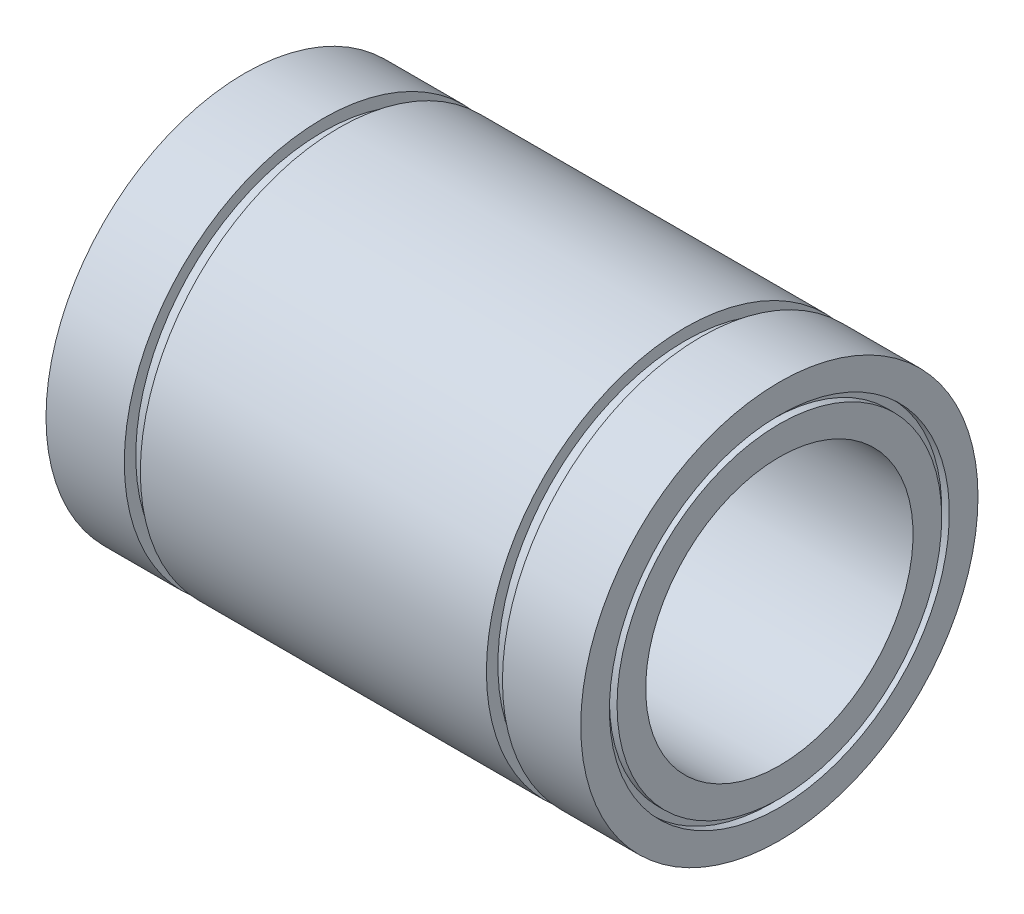
ISO-10303-21;
HEADER;
FILE_DESCRIPTION(('STEP AP214'),'2;1');
FILE_NAME('part.step','',(''),(''),'','','');
FILE_SCHEMA(('AUTOMOTIVE_DESIGN { 1 0 10303 214 1 1 1 1 }'));
ENDSEC;
DATA;
#1=APPLICATION_CONTEXT('core data for automotive mechanical design processes');
#2=APPLICATION_PROTOCOL_DEFINITION('international standard','automotive_design',2000,#1);
#3=PRODUCT_CONTEXT('',#1,'mechanical');
#4=PRODUCT('Part','Part','',(#3));
#5=PRODUCT_RELATED_PRODUCT_CATEGORY('part','',(#4));
#6=PRODUCT_DEFINITION_FORMATION('','',#4);
#7=PRODUCT_DEFINITION_CONTEXT('part definition',#1,'design');
#8=PRODUCT_DEFINITION('design','',#6,#7);
#9=PRODUCT_DEFINITION_SHAPE('','',#8);
#10=(LENGTH_UNIT() NAMED_UNIT(*) SI_UNIT(.MILLI.,.METRE.));
#11=(NAMED_UNIT(*) PLANE_ANGLE_UNIT() SI_UNIT($,.RADIAN.));
#12=(NAMED_UNIT(*) SI_UNIT($,.STERADIAN.) SOLID_ANGLE_UNIT());
#13=UNCERTAINTY_MEASURE_WITH_UNIT(LENGTH_MEASURE(1.E-05),#10,'distance_accuracy_value','');
#14=(GEOMETRIC_REPRESENTATION_CONTEXT(3) GLOBAL_UNCERTAINTY_ASSIGNED_CONTEXT((#13)) GLOBAL_UNIT_ASSIGNED_CONTEXT((#10,
#11,#12)) REPRESENTATION_CONTEXT('',''));
#15=CARTESIAN_POINT('',(0.,0.,0.));
#16=DIRECTION('',(0.,0.,1.));
#17=DIRECTION('',(1.,0.,0.));
#18=AXIS2_PLACEMENT_3D('',#15,#16,#17);
#19=CARTESIAN_POINT('',(-35.,22.25,0.));
#20=DIRECTION('',(-1.,0.,0.));
#21=DIRECTION('',(0.,-1.,0.));
#22=AXIS2_PLACEMENT_3D('',#19,#20,#21);
#23=PLANE('',#22);
#24=CARTESIAN_POINT('',(-35.,0.,0.));
#25=DIRECTION('',(1.,0.,0.));
#26=DIRECTION('',(0.,1.,0.));
#27=AXIS2_PLACEMENT_3D('',#24,#25,#26);
#28=CIRCLE('',#27,22.25);
#29=CARTESIAN_POINT('',(-35.,22.25,0.));
#30=VERTEX_POINT('',#29);
#31=EDGE_CURVE('E123',#30,#30,#28,.T.);
#32=ORIENTED_EDGE('',*,*,#31,.T.);
#33=EDGE_LOOP('',(#32));
#34=FACE_BOUND('',#33,.T.);
#35=CARTESIAN_POINT('',(-35.,0.,0.));
#36=DIRECTION('',(1.,0.,0.));
#37=DIRECTION('',(0.,1.,0.));
#38=AXIS2_PLACEMENT_3D('',#35,#36,#37);
#39=CIRCLE('',#38,26.);
#40=CARTESIAN_POINT('',(-35.,26.,0.));
#41=VERTEX_POINT('',#40);
#42=EDGE_CURVE('E10',#41,#41,#39,.T.);
#43=ORIENTED_EDGE('',*,*,#42,.F.);
#44=EDGE_LOOP('',(#43));
#45=FACE_BOUND('',#44,.T.);
#46=ADVANCED_FACE('F40',(#34,#45),#23,.T.);
#47=CARTESIAN_POINT('',(0.,0.,0.));
#48=DIRECTION('',(1.,0.,0.));
#49=DIRECTION('',(0.,1.,0.));
#50=AXIS2_PLACEMENT_3D('',#47,#48,#49);
#51=CYLINDRICAL_SURFACE('',#50,26.);
#52=ORIENTED_EDGE('',*,*,#42,.T.);
#53=EDGE_LOOP('',(#52));
#54=FACE_BOUND('',#53,.T.);
#55=CARTESIAN_POINT('',(-24.75,0.,0.));
#56=DIRECTION('',(1.,0.,0.));
#57=DIRECTION('',(0.,1.,0.));
#58=AXIS2_PLACEMENT_3D('',#55,#56,#57);
#59=CIRCLE('',#58,26.);
#60=CARTESIAN_POINT('',(-24.75,26.,0.));
#61=VERTEX_POINT('',#60);
#62=EDGE_CURVE('E47',#61,#61,#59,.T.);
#63=ORIENTED_EDGE('',*,*,#62,.F.);
#64=EDGE_LOOP('',(#63));
#65=FACE_BOUND('',#64,.T.);
#66=ADVANCED_FACE('F142',(#54,#65),#51,.T.);
#67=CARTESIAN_POINT('',(-24.75,26.,0.));
#68=DIRECTION('',(1.,0.,0.));
#69=DIRECTION('',(0.,1.,0.));
#70=AXIS2_PLACEMENT_3D('',#67,#68,#69);
#71=PLANE('',#70);
#72=ORIENTED_EDGE('',*,*,#62,.T.);
#73=EDGE_LOOP('',(#72));
#74=FACE_BOUND('',#73,.T.);
#75=CARTESIAN_POINT('',(-24.75,0.,0.));
#76=DIRECTION('',(1.,0.,0.));
#77=DIRECTION('',(0.,1.,0.));
#78=AXIS2_PLACEMENT_3D('',#75,#76,#77);
#79=CIRCLE('',#78,24.5);
#80=CARTESIAN_POINT('',(-24.75,24.5,0.));
#81=VERTEX_POINT('',#80);
#82=EDGE_CURVE('E53',#81,#81,#79,.T.);
#83=ORIENTED_EDGE('',*,*,#82,.F.);
#84=EDGE_LOOP('',(#83));
#85=FACE_BOUND('',#84,.T.);
#86=ADVANCED_FACE('F146',(#74,#85),#71,.T.);
#87=CARTESIAN_POINT('',(0.,0.,0.));
#88=DIRECTION('',(1.,0.,0.));
#89=DIRECTION('',(0.,1.,0.));
#90=AXIS2_PLACEMENT_3D('',#87,#88,#89);
#91=CYLINDRICAL_SURFACE('',#90,24.5);
#92=ORIENTED_EDGE('',*,*,#82,.T.);
#93=EDGE_LOOP('',(#92));
#94=FACE_BOUND('',#93,.T.);
#95=CARTESIAN_POINT('',(-22.65,0.,0.));
#96=DIRECTION('',(1.,0.,0.));
#97=DIRECTION('',(0.,1.,0.));
#98=AXIS2_PLACEMENT_3D('',#95,#96,#97);
#99=CIRCLE('',#98,24.5);
#100=CARTESIAN_POINT('',(-22.65,24.5,0.));
#101=VERTEX_POINT('',#100);
#102=EDGE_CURVE('E59',#101,#101,#99,.T.);
#103=ORIENTED_EDGE('',*,*,#102,.F.);
#104=EDGE_LOOP('',(#103));
#105=FACE_BOUND('',#104,.T.);
#106=ADVANCED_FACE('F150',(#94,#105),#91,.T.);
#107=CARTESIAN_POINT('',(-22.65,24.5,0.));
#108=DIRECTION('',(-1.,0.,0.));
#109=DIRECTION('',(0.,-1.,0.));
#110=AXIS2_PLACEMENT_3D('',#107,#108,#109);
#111=PLANE('',#110);
#112=ORIENTED_EDGE('',*,*,#102,.T.);
#113=EDGE_LOOP('',(#112));
#114=FACE_BOUND('',#113,.T.);
#115=CARTESIAN_POINT('',(-22.65,0.,0.));
#116=DIRECTION('',(1.,0.,0.));
#117=DIRECTION('',(0.,1.,0.));
#118=AXIS2_PLACEMENT_3D('',#115,#116,#117);
#119=CIRCLE('',#118,26.);
#120=CARTESIAN_POINT('',(-22.65,26.,0.));
#121=VERTEX_POINT('',#120);
#122=EDGE_CURVE('E65',#121,#121,#119,.T.);
#123=ORIENTED_EDGE('',*,*,#122,.F.);
#124=EDGE_LOOP('',(#123));
#125=FACE_BOUND('',#124,.T.);
#126=ADVANCED_FACE('F156',(#114,#125),#111,.T.);
#127=CARTESIAN_POINT('',(0.,0.,0.));
#128=DIRECTION('',(1.,0.,0.));
#129=DIRECTION('',(0.,1.,0.));
#130=AXIS2_PLACEMENT_3D('',#127,#128,#129);
#131=CYLINDRICAL_SURFACE('',#130,26.);
#132=ORIENTED_EDGE('',*,*,#122,.T.);
#133=EDGE_LOOP('',(#132));
#134=FACE_BOUND('',#133,.T.);
#135=CARTESIAN_POINT('',(22.65,0.,0.));
#136=DIRECTION('',(1.,0.,0.));
#137=DIRECTION('',(0.,1.,0.));
#138=AXIS2_PLACEMENT_3D('',#135,#136,#137);
#139=CIRCLE('',#138,26.);
#140=CARTESIAN_POINT('',(22.65,26.,0.));
#141=VERTEX_POINT('',#140);
#142=EDGE_CURVE('E68',#141,#141,#139,.T.);
#143=ORIENTED_EDGE('',*,*,#142,.F.);
#144=EDGE_LOOP('',(#143));
#145=FACE_BOUND('',#144,.T.);
#146=ADVANCED_FACE('F160',(#134,#145),#131,.T.);
#147=CARTESIAN_POINT('',(22.65,26.,0.));
#148=DIRECTION('',(1.,0.,0.));
#149=DIRECTION('',(0.,1.,0.));
#150=AXIS2_PLACEMENT_3D('',#147,#148,#149);
#151=PLANE('',#150);
#152=ORIENTED_EDGE('',*,*,#142,.T.);
#153=EDGE_LOOP('',(#152));
#154=FACE_BOUND('',#153,.T.);
#155=CARTESIAN_POINT('',(22.65,0.,0.));
#156=DIRECTION('',(1.,0.,0.));
#157=DIRECTION('',(0.,1.,0.));
#158=AXIS2_PLACEMENT_3D('',#155,#156,#157);
#159=CIRCLE('',#158,24.5);
#160=CARTESIAN_POINT('',(22.65,24.5,0.));
#161=VERTEX_POINT('',#160);
#162=EDGE_CURVE('E72',#161,#161,#159,.T.);
#163=ORIENTED_EDGE('',*,*,#162,.F.);
#164=EDGE_LOOP('',(#163));
#165=FACE_BOUND('',#164,.T.);
#166=ADVANCED_FACE('F164',(#154,#165),#151,.T.);
#167=CARTESIAN_POINT('',(0.,0.,0.));
#168=DIRECTION('',(1.,0.,0.));
#169=DIRECTION('',(0.,1.,0.));
#170=AXIS2_PLACEMENT_3D('',#167,#168,#169);
#171=CYLINDRICAL_SURFACE('',#170,24.5);
#172=ORIENTED_EDGE('',*,*,#162,.T.);
#173=EDGE_LOOP('',(#172));
#174=FACE_BOUND('',#173,.T.);
#175=CARTESIAN_POINT('',(24.75,0.,0.));
#176=DIRECTION('',(1.,0.,0.));
#177=DIRECTION('',(0.,1.,0.));
#178=AXIS2_PLACEMENT_3D('',#175,#176,#177);
#179=CIRCLE('',#178,24.5);
#180=CARTESIAN_POINT('',(24.75,24.5,0.));
#181=VERTEX_POINT('',#180);
#182=EDGE_CURVE('E76',#181,#181,#179,.T.);
#183=ORIENTED_EDGE('',*,*,#182,.F.);
#184=EDGE_LOOP('',(#183));
#185=FACE_BOUND('',#184,.T.);
#186=ADVANCED_FACE('F168',(#174,#185),#171,.T.);
#187=CARTESIAN_POINT('',(24.75,24.5,0.));
#188=DIRECTION('',(-1.,0.,0.));
#189=DIRECTION('',(0.,-1.,0.));
#190=AXIS2_PLACEMENT_3D('',#187,#188,#189);
#191=PLANE('',#190);
#192=ORIENTED_EDGE('',*,*,#182,.T.);
#193=EDGE_LOOP('',(#192));
#194=FACE_BOUND('',#193,.T.);
#195=CARTESIAN_POINT('',(24.75,0.,0.));
#196=DIRECTION('',(1.,0.,0.));
#197=DIRECTION('',(0.,1.,0.));
#198=AXIS2_PLACEMENT_3D('',#195,#196,#197);
#199=CIRCLE('',#198,26.);
#200=CARTESIAN_POINT('',(24.75,26.,0.));
#201=VERTEX_POINT('',#200);
#202=EDGE_CURVE('E80',#201,#201,#199,.T.);
#203=ORIENTED_EDGE('',*,*,#202,.F.);
#204=EDGE_LOOP('',(#203));
#205=FACE_BOUND('',#204,.T.);
#206=ADVANCED_FACE('F172',(#194,#205),#191,.T.);
#207=CARTESIAN_POINT('',(0.,0.,0.));
#208=DIRECTION('',(1.,0.,0.));
#209=DIRECTION('',(0.,1.,0.));
#210=AXIS2_PLACEMENT_3D('',#207,#208,#209);
#211=CYLINDRICAL_SURFACE('',#210,26.);
#212=ORIENTED_EDGE('',*,*,#202,.T.);
#213=EDGE_LOOP('',(#212));
#214=FACE_BOUND('',#213,.T.);
#215=CARTESIAN_POINT('',(35.,0.,0.));
#216=DIRECTION('',(1.,0.,0.));
#217=DIRECTION('',(0.,1.,0.));
#218=AXIS2_PLACEMENT_3D('',#215,#216,#217);
#219=CIRCLE('',#218,25.9999999999999);
#220=CARTESIAN_POINT('',(35.,25.9999999999999,0.));
#221=VERTEX_POINT('',#220);
#222=EDGE_CURVE('E84',#221,#221,#219,.T.);
#223=ORIENTED_EDGE('',*,*,#222,.F.);
#224=EDGE_LOOP('',(#223));
#225=FACE_BOUND('',#224,.T.);
#226=ADVANCED_FACE('F176',(#214,#225),#211,.T.);
#227=CARTESIAN_POINT('',(35.,25.9999999999999,0.));
#228=DIRECTION('',(1.,0.,0.));
#229=DIRECTION('',(0.,1.,0.));
#230=AXIS2_PLACEMENT_3D('',#227,#228,#229);
#231=PLANE('',#230);
#232=ORIENTED_EDGE('',*,*,#222,.T.);
#233=EDGE_LOOP('',(#232));
#234=FACE_BOUND('',#233,.T.);
#235=CARTESIAN_POINT('',(35.,0.,0.));
#236=DIRECTION('',(1.,0.,0.));
#237=DIRECTION('',(0.,1.,0.));
#238=AXIS2_PLACEMENT_3D('',#235,#236,#237);
#239=CIRCLE('',#238,22.25);
#240=CARTESIAN_POINT('',(35.,22.25,0.));
#241=VERTEX_POINT('',#240);
#242=EDGE_CURVE('E88',#241,#241,#239,.T.);
#243=ORIENTED_EDGE('',*,*,#242,.F.);
#244=EDGE_LOOP('',(#243));
#245=FACE_BOUND('',#244,.T.);
#246=ADVANCED_FACE('F180',(#234,#245),#231,.T.);
#247=CARTESIAN_POINT('',(0.,0.,0.));
#248=DIRECTION('',(1.,0.,0.));
#249=DIRECTION('',(0.,1.,0.));
#250=AXIS2_PLACEMENT_3D('',#247,#248,#249);
#251=CYLINDRICAL_SURFACE('',#250,22.25);
#252=ORIENTED_EDGE('',*,*,#242,.T.);
#253=EDGE_LOOP('',(#252));
#254=FACE_BOUND('',#253,.T.);
#255=CARTESIAN_POINT('',(34.,0.,0.));
#256=DIRECTION('',(1.,0.,0.));
#257=DIRECTION('',(0.,1.,0.));
#258=AXIS2_PLACEMENT_3D('',#255,#256,#257);
#259=CIRCLE('',#258,22.25);
#260=CARTESIAN_POINT('',(34.,22.25,0.));
#261=VERTEX_POINT('',#260);
#262=EDGE_CURVE('E92',#261,#261,#259,.T.);
#263=ORIENTED_EDGE('',*,*,#262,.F.);
#264=EDGE_LOOP('',(#263));
#265=FACE_BOUND('',#264,.T.);
#266=ADVANCED_FACE('F184',(#254,#265),#251,.F.);
#267=CARTESIAN_POINT('',(34.,22.25,0.));
#268=DIRECTION('',(1.,0.,0.));
#269=DIRECTION('',(0.,1.,0.));
#270=AXIS2_PLACEMENT_3D('',#267,#268,#269);
#271=PLANE('',#270);
#272=ORIENTED_EDGE('',*,*,#262,.T.);
#273=EDGE_LOOP('',(#272));
#274=FACE_BOUND('',#273,.T.);
#275=CARTESIAN_POINT('',(34.,0.,0.));
#276=DIRECTION('',(1.,0.,0.));
#277=DIRECTION('',(0.,1.,0.));
#278=AXIS2_PLACEMENT_3D('',#275,#276,#277);
#279=CIRCLE('',#278,21.25);
#280=CARTESIAN_POINT('',(34.,21.25,0.));
#281=VERTEX_POINT('',#280);
#282=EDGE_CURVE('E96',#281,#281,#279,.T.);
#283=ORIENTED_EDGE('',*,*,#282,.F.);
#284=EDGE_LOOP('',(#283));
#285=FACE_BOUND('',#284,.T.);
#286=ADVANCED_FACE('F188',(#274,#285),#271,.T.);
#287=CARTESIAN_POINT('',(0.,0.,0.));
#288=DIRECTION('',(1.,0.,0.));
#289=DIRECTION('',(0.,1.,0.));
#290=AXIS2_PLACEMENT_3D('',#287,#288,#289);
#291=CYLINDRICAL_SURFACE('',#290,21.25);
#292=ORIENTED_EDGE('',*,*,#282,.T.);
#293=EDGE_LOOP('',(#292));
#294=FACE_BOUND('',#293,.T.);
#295=CARTESIAN_POINT('',(35.,0.,0.));
#296=DIRECTION('',(1.,0.,0.));
#297=DIRECTION('',(0.,1.,0.));
#298=AXIS2_PLACEMENT_3D('',#295,#296,#297);
#299=CIRCLE('',#298,21.25);
#300=CARTESIAN_POINT('',(35.,21.25,0.));
#301=VERTEX_POINT('',#300);
#302=EDGE_CURVE('E100',#301,#301,#299,.T.);
#303=ORIENTED_EDGE('',*,*,#302,.F.);
#304=EDGE_LOOP('',(#303));
#305=FACE_BOUND('',#304,.T.);
#306=ADVANCED_FACE('F192',(#294,#305),#291,.T.);
#307=CARTESIAN_POINT('',(35.,21.25,0.));
#308=DIRECTION('',(1.,0.,0.));
#309=DIRECTION('',(0.,1.,0.));
#310=AXIS2_PLACEMENT_3D('',#307,#308,#309);
#311=PLANE('',#310);
#312=ORIENTED_EDGE('',*,*,#302,.T.);
#313=EDGE_LOOP('',(#312));
#314=FACE_BOUND('',#313,.T.);
#315=CARTESIAN_POINT('',(35.,0.,0.));
#316=DIRECTION('',(1.,0.,0.));
#317=DIRECTION('',(0.,1.,0.));
#318=AXIS2_PLACEMENT_3D('',#315,#316,#317);
#319=CIRCLE('',#318,17.5);
#320=CARTESIAN_POINT('',(35.,17.5,0.));
#321=VERTEX_POINT('',#320);
#322=EDGE_CURVE('E104',#321,#321,#319,.T.);
#323=ORIENTED_EDGE('',*,*,#322,.F.);
#324=EDGE_LOOP('',(#323));
#325=FACE_BOUND('',#324,.T.);
#326=ADVANCED_FACE('F196',(#314,#325),#311,.T.);
#327=CARTESIAN_POINT('',(0.,0.,0.));
#328=DIRECTION('',(1.,0.,0.));
#329=DIRECTION('',(0.,1.,0.));
#330=AXIS2_PLACEMENT_3D('',#327,#328,#329);
#331=CYLINDRICAL_SURFACE('',#330,17.5);
#332=ORIENTED_EDGE('',*,*,#322,.T.);
#333=EDGE_LOOP('',(#332));
#334=FACE_BOUND('',#333,.T.);
#335=CARTESIAN_POINT('',(-35.,0.,0.));
#336=DIRECTION('',(1.,0.,0.));
#337=DIRECTION('',(0.,1.,0.));
#338=AXIS2_PLACEMENT_3D('',#335,#336,#337);
#339=CIRCLE('',#338,17.5);
#340=CARTESIAN_POINT('',(-35.,17.5,0.));
#341=VERTEX_POINT('',#340);
#342=EDGE_CURVE('E108',#341,#341,#339,.T.);
#343=ORIENTED_EDGE('',*,*,#342,.F.);
#344=EDGE_LOOP('',(#343));
#345=FACE_BOUND('',#344,.T.);
#346=ADVANCED_FACE('F200',(#334,#345),#331,.F.);
#347=CARTESIAN_POINT('',(-35.,17.5,0.));
#348=DIRECTION('',(-1.,0.,0.));
#349=DIRECTION('',(0.,-1.,0.));
#350=AXIS2_PLACEMENT_3D('',#347,#348,#349);
#351=PLANE('',#350);
#352=ORIENTED_EDGE('',*,*,#342,.T.);
#353=EDGE_LOOP('',(#352));
#354=FACE_BOUND('',#353,.T.);
#355=CARTESIAN_POINT('',(-35.,0.,0.));
#356=DIRECTION('',(1.,0.,0.));
#357=DIRECTION('',(0.,1.,0.));
#358=AXIS2_PLACEMENT_3D('',#355,#356,#357);
#359=CIRCLE('',#358,21.25);
#360=CARTESIAN_POINT('',(-35.,21.25,0.));
#361=VERTEX_POINT('',#360);
#362=EDGE_CURVE('E111',#361,#361,#359,.T.);
#363=ORIENTED_EDGE('',*,*,#362,.F.);
#364=EDGE_LOOP('',(#363));
#365=FACE_BOUND('',#364,.T.);
#366=ADVANCED_FACE('F204',(#354,#365),#351,.T.);
#367=CARTESIAN_POINT('',(0.,0.,0.));
#368=DIRECTION('',(1.,0.,0.));
#369=DIRECTION('',(0.,1.,0.));
#370=AXIS2_PLACEMENT_3D('',#367,#368,#369);
#371=CYLINDRICAL_SURFACE('',#370,21.25);
#372=ORIENTED_EDGE('',*,*,#362,.T.);
#373=EDGE_LOOP('',(#372));
#374=FACE_BOUND('',#373,.T.);
#375=CARTESIAN_POINT('',(-34.,0.,0.));
#376=DIRECTION('',(1.,0.,0.));
#377=DIRECTION('',(0.,1.,0.));
#378=AXIS2_PLACEMENT_3D('',#375,#376,#377);
#379=CIRCLE('',#378,21.25);
#380=CARTESIAN_POINT('',(-34.,21.25,0.));
#381=VERTEX_POINT('',#380);
#382=EDGE_CURVE('E115',#381,#381,#379,.T.);
#383=ORIENTED_EDGE('',*,*,#382,.F.);
#384=EDGE_LOOP('',(#383));
#385=FACE_BOUND('',#384,.T.);
#386=ADVANCED_FACE('F138',(#374,#385),#371,.T.);
#387=CARTESIAN_POINT('',(-34.,22.25,0.));
#388=DIRECTION('',(-1.,0.,0.));
#389=DIRECTION('',(0.,-1.,0.));
#390=AXIS2_PLACEMENT_3D('',#387,#388,#389);
#391=PLANE('',#390);
#392=ORIENTED_EDGE('',*,*,#382,.T.);
#393=EDGE_LOOP('',(#392));
#394=FACE_BOUND('',#393,.T.);
#395=CARTESIAN_POINT('',(-34.,0.,0.));
#396=DIRECTION('',(1.,0.,0.));
#397=DIRECTION('',(0.,1.,0.));
#398=AXIS2_PLACEMENT_3D('',#395,#396,#397);
#399=CIRCLE('',#398,22.25);
#400=CARTESIAN_POINT('',(-34.,22.25,0.));
#401=VERTEX_POINT('',#400);
#402=EDGE_CURVE('E119',#401,#401,#399,.T.);
#403=ORIENTED_EDGE('',*,*,#402,.F.);
#404=EDGE_LOOP('',(#403));
#405=FACE_BOUND('',#404,.T.);
#406=ADVANCED_FACE('F132',(#394,#405),#391,.T.);
#407=CARTESIAN_POINT('',(0.,0.,0.));
#408=DIRECTION('',(1.,0.,0.));
#409=DIRECTION('',(0.,1.,0.));
#410=AXIS2_PLACEMENT_3D('',#407,#408,#409);
#411=CYLINDRICAL_SURFACE('',#410,22.25);
#412=ORIENTED_EDGE('',*,*,#402,.T.);
#413=EDGE_LOOP('',(#412));
#414=FACE_BOUND('',#413,.T.);
#415=ORIENTED_EDGE('',*,*,#31,.F.);
#416=EDGE_LOOP('',(#415));
#417=FACE_BOUND('',#416,.T.);
#418=ADVANCED_FACE('F130',(#414,#417),#411,.F.);
#419=CLOSED_SHELL('',(#46,#66,#86,#106,#126,#146,#166,#186,#206,#226,#246,#266,#286,#306,#326,
#346,#366,#386,#406,#418));
#420=MANIFOLD_SOLID_BREP('B2',#419);
#421=ADVANCED_BREP_SHAPE_REPRESENTATION('',(#18,#420),#14);
#422=SHAPE_DEFINITION_REPRESENTATION(#9,#421);
ENDSEC;
END-ISO-10303-21;
